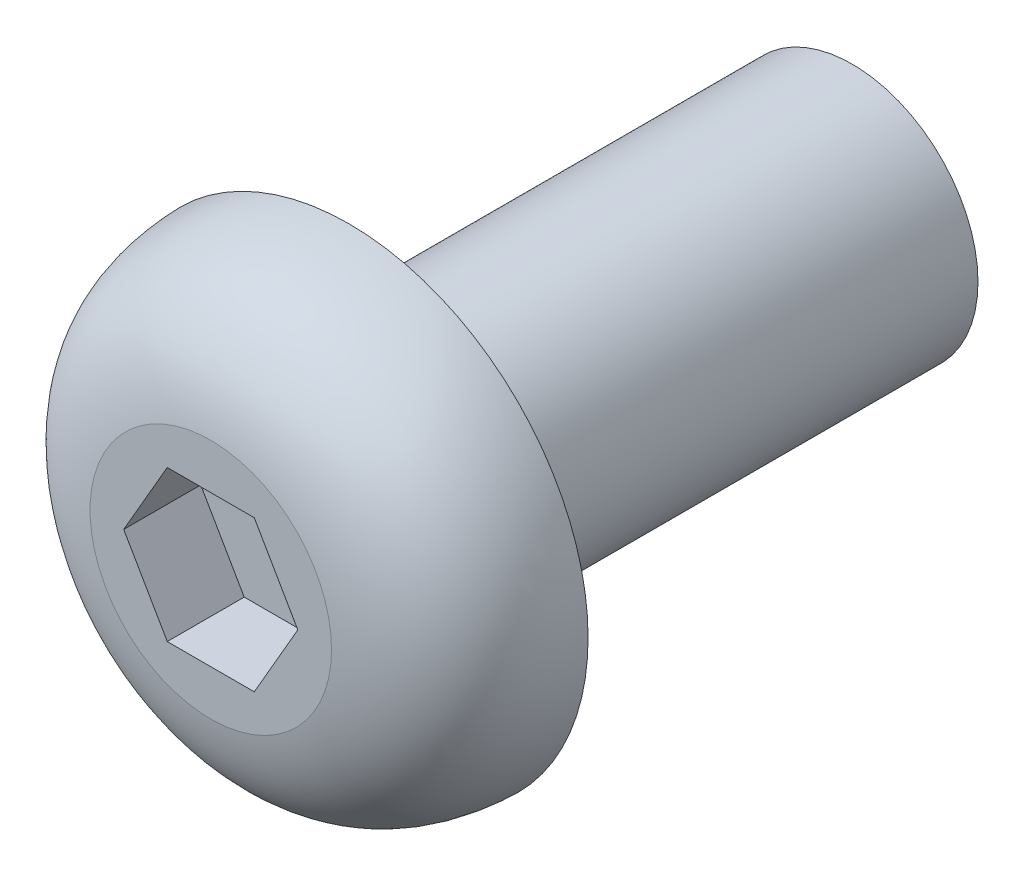
ISO-10303-21;
HEADER;
FILE_DESCRIPTION(('STEP AP214'),'2;1');
FILE_NAME('part.step','',(''),(''),'','','');
FILE_SCHEMA(('AUTOMOTIVE_DESIGN { 1 0 10303 214 1 1 1 1 }'));
ENDSEC;
DATA;
#1=APPLICATION_CONTEXT('core data for automotive mechanical design processes');
#2=APPLICATION_PROTOCOL_DEFINITION('international standard','automotive_design',2000,#1);
#3=PRODUCT_CONTEXT('',#1,'mechanical');
#4=PRODUCT('Part','Part','',(#3));
#5=PRODUCT_RELATED_PRODUCT_CATEGORY('part','',(#4));
#6=PRODUCT_DEFINITION_FORMATION('','',#4);
#7=PRODUCT_DEFINITION_CONTEXT('part definition',#1,'design');
#8=PRODUCT_DEFINITION('design','',#6,#7);
#9=PRODUCT_DEFINITION_SHAPE('','',#8);
#10=(LENGTH_UNIT() NAMED_UNIT(*) SI_UNIT(.MILLI.,.METRE.));
#11=(NAMED_UNIT(*) PLANE_ANGLE_UNIT() SI_UNIT($,.RADIAN.));
#12=(NAMED_UNIT(*) SI_UNIT($,.STERADIAN.) SOLID_ANGLE_UNIT());
#13=UNCERTAINTY_MEASURE_WITH_UNIT(LENGTH_MEASURE(1.E-05),#10,'distance_accuracy_value','');
#14=(GEOMETRIC_REPRESENTATION_CONTEXT(3) GLOBAL_UNCERTAINTY_ASSIGNED_CONTEXT((#13)) GLOBAL_UNIT_ASSIGNED_CONTEXT((#10,
#11,#12)) REPRESENTATION_CONTEXT('',''));
#15=CARTESIAN_POINT('',(0.,0.,0.));
#16=DIRECTION('',(0.,0.,1.));
#17=DIRECTION('',(1.,0.,0.));
#18=AXIS2_PLACEMENT_3D('',#15,#16,#17);
#19=CARTESIAN_POINT('',(0.,0.,1.22));
#20=DIRECTION('',(0.,0.,1.));
#21=DIRECTION('',(1.,0.,0.));
#22=AXIS2_PLACEMENT_3D('',#19,#20,#21);
#23=PLANE('',#22);
#24=DIRECTION('',(-0.50000000000019,0.866025403784329,0.));
#25=VECTOR('',#24,1.);
#26=CARTESIAN_POINT('',(1.73,0.,1.22));
#27=LINE('',#26,#25);
#28=CARTESIAN_POINT('',(1.73,0.,1.22));
#29=VERTEX_POINT('',#28);
#30=CARTESIAN_POINT('',(0.865,1.498223948547,1.22));
#31=VERTEX_POINT('',#30);
#32=EDGE_CURVE('E11',#29,#31,#27,.T.);
#33=ORIENTED_EDGE('',*,*,#32,.T.);
#34=DIRECTION('',(-1.,0.,0.));
#35=VECTOR('',#34,1.);
#36=CARTESIAN_POINT('',(0.865,1.498223948547,1.22));
#37=LINE('',#36,#35);
#38=CARTESIAN_POINT('',(-0.865,1.498223948547,1.22));
#39=VERTEX_POINT('',#38);
#40=EDGE_CURVE('E153',#31,#39,#37,.T.);
#41=ORIENTED_EDGE('',*,*,#40,.T.);
#42=DIRECTION('',(-0.50000000000019,-0.866025403784329,0.));
#43=VECTOR('',#42,1.);
#44=CARTESIAN_POINT('',(-0.865,1.498223948547,1.22));
#45=LINE('',#44,#43);
#46=CARTESIAN_POINT('',(-1.73,0.,1.22));
#47=VERTEX_POINT('',#46);
#48=EDGE_CURVE('E110',#39,#47,#45,.T.);
#49=ORIENTED_EDGE('',*,*,#48,.T.);
#50=DIRECTION('',(0.50000000000019,-0.866025403784329,0.));
#51=VECTOR('',#50,1.);
#52=CARTESIAN_POINT('',(-1.73,0.,1.22));
#53=LINE('',#52,#51);
#54=CARTESIAN_POINT('',(-0.865,-1.498223948547,1.22));
#55=VERTEX_POINT('',#54);
#56=EDGE_CURVE('E107',#47,#55,#53,.T.);
#57=ORIENTED_EDGE('',*,*,#56,.T.);
#58=DIRECTION('',(1.,0.,0.));
#59=VECTOR('',#58,1.);
#60=CARTESIAN_POINT('',(-0.865,-1.498223948547,1.22));
#61=LINE('',#60,#59);
#62=CARTESIAN_POINT('',(0.865,-1.498223948547,1.22));
#63=VERTEX_POINT('',#62);
#64=EDGE_CURVE('E143',#55,#63,#61,.T.);
#65=ORIENTED_EDGE('',*,*,#64,.T.);
#66=DIRECTION('',(0.50000000000019,0.866025403784329,0.));
#67=VECTOR('',#66,1.);
#68=CARTESIAN_POINT('',(0.865,-1.498223948547,1.22));
#69=LINE('',#68,#67);
#70=EDGE_CURVE('E137',#63,#29,#69,.T.);
#71=ORIENTED_EDGE('',*,*,#70,.T.);
#72=EDGE_LOOP('',(#33,#41,#49,#57,#65,#71));
#73=FACE_BOUND('',#72,.T.);
#74=ADVANCED_FACE('F36',(#73),#23,.T.);
#75=CARTESIAN_POINT('',(1.73,0.,1.22));
#76=DIRECTION('',(-0.866025403784329,-0.50000000000019,0.));
#77=DIRECTION('',(-0.50000000000019,0.866025403784329,0.));
#78=AXIS2_PLACEMENT_3D('',#75,#76,#77);
#79=PLANE('',#78);
#80=ORIENTED_EDGE('',*,*,#32,.F.);
#81=DIRECTION('',(0.,0.,1.));
#82=VECTOR('',#81,1.);
#83=CARTESIAN_POINT('',(1.73,0.,1.22));
#84=LINE('',#83,#82);
#85=CARTESIAN_POINT('',(1.73,0.,2.75));
#86=VERTEX_POINT('',#85);
#87=EDGE_CURVE('E164',#29,#86,#84,.T.);
#88=ORIENTED_EDGE('',*,*,#87,.T.);
#89=DIRECTION('',(-0.50000000000019,0.866025403784329,0.));
#90=VECTOR('',#89,1.);
#91=CARTESIAN_POINT('',(1.51375,0.374555987137,2.75));
#92=LINE('',#91,#90);
#93=CARTESIAN_POINT('',(0.865,1.498223948547,2.75));
#94=VERTEX_POINT('',#93);
#95=EDGE_CURVE('E150',#86,#94,#92,.T.);
#96=ORIENTED_EDGE('',*,*,#95,.T.);
#97=DIRECTION('',(0.,0.,1.));
#98=VECTOR('',#97,1.);
#99=CARTESIAN_POINT('',(0.865,1.498223948547,1.22));
#100=LINE('',#99,#98);
#101=EDGE_CURVE('E45',#31,#94,#100,.T.);
#102=ORIENTED_EDGE('',*,*,#101,.F.);
#103=EDGE_LOOP('',(#80,#88,#96,#102));
#104=FACE_BOUND('',#103,.T.);
#105=ADVANCED_FACE('F190',(#104),#79,.T.);
#106=CARTESIAN_POINT('',(0.865,1.498223948547,1.22));
#107=DIRECTION('',(0.,-1.,0.));
#108=DIRECTION('',(-1.,0.,0.));
#109=AXIS2_PLACEMENT_3D('',#106,#107,#108);
#110=PLANE('',#109);
#111=ORIENTED_EDGE('',*,*,#40,.F.);
#112=ORIENTED_EDGE('',*,*,#101,.T.);
#113=DIRECTION('',(-1.,0.,0.));
#114=VECTOR('',#113,1.);
#115=CARTESIAN_POINT('',(0.4325,1.498223948547,2.75));
#116=LINE('',#115,#114);
#117=CARTESIAN_POINT('',(-0.865,1.498223948547,2.75));
#118=VERTEX_POINT('',#117);
#119=EDGE_CURVE('E120',#94,#118,#116,.T.);
#120=ORIENTED_EDGE('',*,*,#119,.T.);
#121=DIRECTION('',(0.,0.,1.));
#122=VECTOR('',#121,1.);
#123=CARTESIAN_POINT('',(-0.865,1.498223948547,1.22));
#124=LINE('',#123,#122);
#125=EDGE_CURVE('E116',#39,#118,#124,.T.);
#126=ORIENTED_EDGE('',*,*,#125,.F.);
#127=EDGE_LOOP('',(#111,#112,#120,#126));
#128=FACE_BOUND('',#127,.T.);
#129=ADVANCED_FACE('F157',(#128),#110,.T.);
#130=CARTESIAN_POINT('',(-0.865,1.498223948547,1.22));
#131=DIRECTION('',(0.866025403784329,-0.50000000000019,0.));
#132=DIRECTION('',(0.,0.,-1.));
#133=AXIS2_PLACEMENT_3D('',#130,#131,#132);
#134=PLANE('',#133);
#135=ORIENTED_EDGE('',*,*,#48,.F.);
#136=ORIENTED_EDGE('',*,*,#125,.T.);
#137=DIRECTION('',(-0.50000000000019,-0.866025403784329,0.));
#138=VECTOR('',#137,1.);
#139=CARTESIAN_POINT('',(-1.08125,1.12366796141,2.75));
#140=LINE('',#139,#138);
#141=CARTESIAN_POINT('',(-1.73,0.,2.75));
#142=VERTEX_POINT('',#141);
#143=EDGE_CURVE('E113',#118,#142,#140,.T.);
#144=ORIENTED_EDGE('',*,*,#143,.T.);
#145=DIRECTION('',(0.,0.,1.));
#146=VECTOR('',#145,1.);
#147=CARTESIAN_POINT('',(-1.73,0.,1.22));
#148=LINE('',#147,#146);
#149=EDGE_CURVE('E100',#47,#142,#148,.T.);
#150=ORIENTED_EDGE('',*,*,#149,.F.);
#151=EDGE_LOOP('',(#135,#136,#144,#150));
#152=FACE_BOUND('',#151,.T.);
#153=ADVANCED_FACE('F114',(#152),#134,.T.);
#154=CARTESIAN_POINT('',(-1.73,0.,1.22));
#155=DIRECTION('',(0.866025403784329,0.50000000000019,0.));
#156=DIRECTION('',(0.,0.,-1.));
#157=AXIS2_PLACEMENT_3D('',#154,#155,#156);
#158=PLANE('',#157);
#159=ORIENTED_EDGE('',*,*,#56,.F.);
#160=ORIENTED_EDGE('',*,*,#149,.T.);
#161=DIRECTION('',(0.50000000000019,-0.866025403784329,0.));
#162=VECTOR('',#161,1.);
#163=CARTESIAN_POINT('',(-1.51375,-0.374555987137,2.75));
#164=LINE('',#163,#162);
#165=CARTESIAN_POINT('',(-0.865,-1.498223948547,2.75));
#166=VERTEX_POINT('',#165);
#167=EDGE_CURVE('E105',#142,#166,#164,.T.);
#168=ORIENTED_EDGE('',*,*,#167,.T.);
#169=DIRECTION('',(0.,0.,1.));
#170=VECTOR('',#169,1.);
#171=CARTESIAN_POINT('',(-0.865,-1.498223948547,1.22));
#172=LINE('',#171,#170);
#173=EDGE_CURVE('E141',#55,#166,#172,.T.);
#174=ORIENTED_EDGE('',*,*,#173,.F.);
#175=EDGE_LOOP('',(#159,#160,#168,#174));
#176=FACE_BOUND('',#175,.T.);
#177=ADVANCED_FACE('F102',(#176),#158,.T.);
#178=CARTESIAN_POINT('',(-0.865,-1.498223948547,1.22));
#179=DIRECTION('',(0.,1.,0.));
#180=DIRECTION('',(1.,0.,0.));
#181=AXIS2_PLACEMENT_3D('',#178,#179,#180);
#182=PLANE('',#181);
#183=ORIENTED_EDGE('',*,*,#64,.F.);
#184=ORIENTED_EDGE('',*,*,#173,.T.);
#185=DIRECTION('',(1.,0.,0.));
#186=VECTOR('',#185,1.);
#187=CARTESIAN_POINT('',(-0.4325,-1.498223948547,2.75));
#188=LINE('',#187,#186);
#189=CARTESIAN_POINT('',(0.865,-1.498223948547,2.75));
#190=VERTEX_POINT('',#189);
#191=EDGE_CURVE('E126',#166,#190,#188,.T.);
#192=ORIENTED_EDGE('',*,*,#191,.T.);
#193=DIRECTION('',(0.,0.,1.));
#194=VECTOR('',#193,1.);
#195=CARTESIAN_POINT('',(0.865,-1.498223948547,1.22));
#196=LINE('',#195,#194);
#197=EDGE_CURVE('E139',#63,#190,#196,.T.);
#198=ORIENTED_EDGE('',*,*,#197,.F.);
#199=EDGE_LOOP('',(#183,#184,#192,#198));
#200=FACE_BOUND('',#199,.T.);
#201=ADVANCED_FACE('F212',(#200),#182,.T.);
#202=CARTESIAN_POINT('',(0.865,-1.498223948547,1.22));
#203=DIRECTION('',(-0.866025403784329,0.50000000000019,0.));
#204=DIRECTION('',(0.,0.,1.));
#205=AXIS2_PLACEMENT_3D('',#202,#203,#204);
#206=PLANE('',#205);
#207=ORIENTED_EDGE('',*,*,#70,.F.);
#208=ORIENTED_EDGE('',*,*,#197,.T.);
#209=DIRECTION('',(0.50000000000019,0.866025403784329,0.));
#210=VECTOR('',#209,1.);
#211=CARTESIAN_POINT('',(1.08125,-1.12366796141,2.75));
#212=LINE('',#211,#210);
#213=EDGE_CURVE('E140',#190,#86,#212,.T.);
#214=ORIENTED_EDGE('',*,*,#213,.T.);
#215=ORIENTED_EDGE('',*,*,#87,.F.);
#216=EDGE_LOOP('',(#207,#208,#214,#215));
#217=FACE_BOUND('',#216,.T.);
#218=ADVANCED_FACE('F214',(#217),#206,.T.);
#219=CARTESIAN_POINT('',(0.,0.,2.75));
#220=DIRECTION('',(0.,0.,1.));
#221=DIRECTION('',(1.,0.,0.));
#222=AXIS2_PLACEMENT_3D('',#219,#220,#221);
#223=PLANE('',#222);
#224=ORIENTED_EDGE('',*,*,#191,.F.);
#225=ORIENTED_EDGE('',*,*,#167,.F.);
#226=ORIENTED_EDGE('',*,*,#143,.F.);
#227=ORIENTED_EDGE('',*,*,#119,.F.);
#228=ORIENTED_EDGE('',*,*,#95,.F.);
#229=ORIENTED_EDGE('',*,*,#213,.F.);
#230=EDGE_LOOP('',(#224,#225,#226,#227,#228,#229));
#231=FACE_BOUND('',#230,.T.);
#232=CARTESIAN_POINT('',(0.,0.,2.75));
#233=DIRECTION('',(0.,0.,1.));
#234=DIRECTION('',(1.,0.,0.));
#235=AXIS2_PLACEMENT_3D('',#232,#233,#234);
#236=CIRCLE('',#235,2.4);
#237=CARTESIAN_POINT('',(2.4,0.,2.75));
#238=VERTEX_POINT('',#237);
#239=EDGE_CURVE('E128',#238,#238,#236,.T.);
#240=ORIENTED_EDGE('',*,*,#239,.T.);
#241=EDGE_LOOP('',(#240));
#242=FACE_BOUND('',#241,.T.);
#243=ADVANCED_FACE('F122',(#231,#242),#223,.T.);
#244=CARTESIAN_POINT('',(2.4,0.,2.75));
#245=CARTESIAN_POINT('',(3.850094,0.,2.523722));
#246=CARTESIAN_POINT('',(4.693085,0.,1.688395));
#247=CARTESIAN_POINT('',(4.75,0.,0.));
#248=(BOUNDED_CURVE() B_SPLINE_CURVE(3,(#244,#245,#246,#247),.UNSPECIFIED.,.F.,
.F.) B_SPLINE_CURVE_WITH_KNOTS((4,4),(0.,1.),
.UNSPECIFIED.) CURVE() GEOMETRIC_REPRESENTATION_ITEM() RATIONAL_B_SPLINE_CURVE((1.,1.,1.,1.)) REPRESENTATION_ITEM(''));
#249=CARTESIAN_POINT('',(0.,0.,0.));
#250=DIRECTION('',(0.,0.,-1.));
#251=AXIS1_PLACEMENT('',#249,#250);
#252=SURFACE_OF_REVOLUTION('',#248,#251);
#253=CARTESIAN_POINT('',(2.4,0.,2.75));
#254=CARTESIAN_POINT('',(3.850094,0.,2.523722));
#255=CARTESIAN_POINT('',(4.693085,0.,1.688395));
#256=CARTESIAN_POINT('',(4.75,0.,0.));
#257=(BOUNDED_CURVE() B_SPLINE_CURVE(3,(#253,#254,#255,#256),.UNSPECIFIED.,.F.,
.F.) B_SPLINE_CURVE_WITH_KNOTS((4,4),(0.,1.),
.UNSPECIFIED.) CURVE() GEOMETRIC_REPRESENTATION_ITEM() RATIONAL_B_SPLINE_CURVE((1.,1.,1.,1.)) REPRESENTATION_ITEM(''));
#258=CARTESIAN_POINT('',(4.75,0.,0.));
#259=VERTEX_POINT('',#258);
#260=EDGE_CURVE('E135',#238,#259,#257,.T.);
#261=ORIENTED_EDGE('',*,*,#260,.T.);
#262=CARTESIAN_POINT('',(0.,0.,0.));
#263=DIRECTION('',(0.,0.,1.));
#264=DIRECTION('',(1.,0.,0.));
#265=AXIS2_PLACEMENT_3D('',#262,#263,#264);
#266=CIRCLE('',#265,4.75);
#267=EDGE_CURVE('E132',#259,#259,#266,.T.);
#268=ORIENTED_EDGE('',*,*,#267,.T.);
#269=ORIENTED_EDGE('',*,*,#260,.F.);
#270=ORIENTED_EDGE('',*,*,#239,.F.);
#271=EDGE_LOOP('',(#261,#268,#269,#270));
#272=FACE_BOUND('',#271,.T.);
#273=ADVANCED_FACE('F178',(#272),#252,.T.);
#274=CARTESIAN_POINT('',(0.,0.,0.));
#275=DIRECTION('',(0.,0.,1.));
#276=DIRECTION('',(1.,0.,0.));
#277=AXIS2_PLACEMENT_3D('',#274,#275,#276);
#278=PLANE('',#277);
#279=ORIENTED_EDGE('',*,*,#267,.F.);
#280=EDGE_LOOP('',(#279));
#281=FACE_BOUND('',#280,.T.);
#282=CARTESIAN_POINT('',(0.,0.,0.));
#283=DIRECTION('',(0.,0.,1.));
#284=DIRECTION('',(1.,0.,0.));
#285=AXIS2_PLACEMENT_3D('',#282,#283,#284);
#286=CIRCLE('',#285,2.5);
#287=CARTESIAN_POINT('',(2.5,0.,0.));
#288=VERTEX_POINT('',#287);
#289=EDGE_CURVE('E136',#288,#288,#286,.T.);
#290=ORIENTED_EDGE('',*,*,#289,.T.);
#291=EDGE_LOOP('',(#290));
#292=FACE_BOUND('',#291,.T.);
#293=ADVANCED_FACE('F38',(#281,#292),#278,.F.);
#294=CARTESIAN_POINT('',(0.,0.,-29.50000000004));
#295=DIRECTION('',(0.,0.,1.));
#296=DIRECTION('',(1.,0.,0.));
#297=AXIS2_PLACEMENT_3D('',#294,#295,#296);
#298=CYLINDRICAL_SURFACE('',#297,2.5);
#299=CARTESIAN_POINT('',(0.,0.,-10.));
#300=DIRECTION('',(0.,0.,1.));
#301=DIRECTION('',(1.,0.,0.));
#302=AXIS2_PLACEMENT_3D('',#299,#300,#301);
#303=CIRCLE('',#302,2.5);
#304=CARTESIAN_POINT('',(2.5,0.,-10.));
#305=VERTEX_POINT('',#304);
#306=EDGE_CURVE('E40',#305,#305,#303,.F.);
#307=ORIENTED_EDGE('',*,*,#306,.F.);
#308=DIRECTION('',(0.,0.,1.));
#309=VECTOR('',#308,1.);
#310=CARTESIAN_POINT('',(2.5,0.,-29.50000000004));
#311=LINE('',#310,#309);
#312=EDGE_CURVE('E171',#305,#288,#311,.T.);
#313=ORIENTED_EDGE('',*,*,#312,.T.);
#314=ORIENTED_EDGE('',*,*,#289,.F.);
#315=ORIENTED_EDGE('',*,*,#312,.F.);
#316=EDGE_LOOP('',(#307,#313,#314,#315));
#317=FACE_BOUND('',#316,.T.);
#318=ADVANCED_FACE('F175',(#317),#298,.T.);
#319=CARTESIAN_POINT('',(0.,0.,-10.));
#320=DIRECTION('',(0.,0.,1.));
#321=DIRECTION('',(1.,0.,0.));
#322=AXIS2_PLACEMENT_3D('',#319,#320,#321);
#323=PLANE('',#322);
#324=ORIENTED_EDGE('',*,*,#306,.T.);
#325=EDGE_LOOP('',(#324));
#326=FACE_BOUND('',#325,.T.);
#327=ADVANCED_FACE('F184',(#326),#323,.F.);
#328=CLOSED_SHELL('',(#74,#105,#129,#153,#177,#201,#218,#243,#273,#293,#318,#327));
#329=MANIFOLD_SOLID_BREP('B2',#328);
#330=ADVANCED_BREP_SHAPE_REPRESENTATION('',(#18,#329),#14);
#331=SHAPE_DEFINITION_REPRESENTATION(#9,#330);
ENDSEC;
END-ISO-10303-21;
